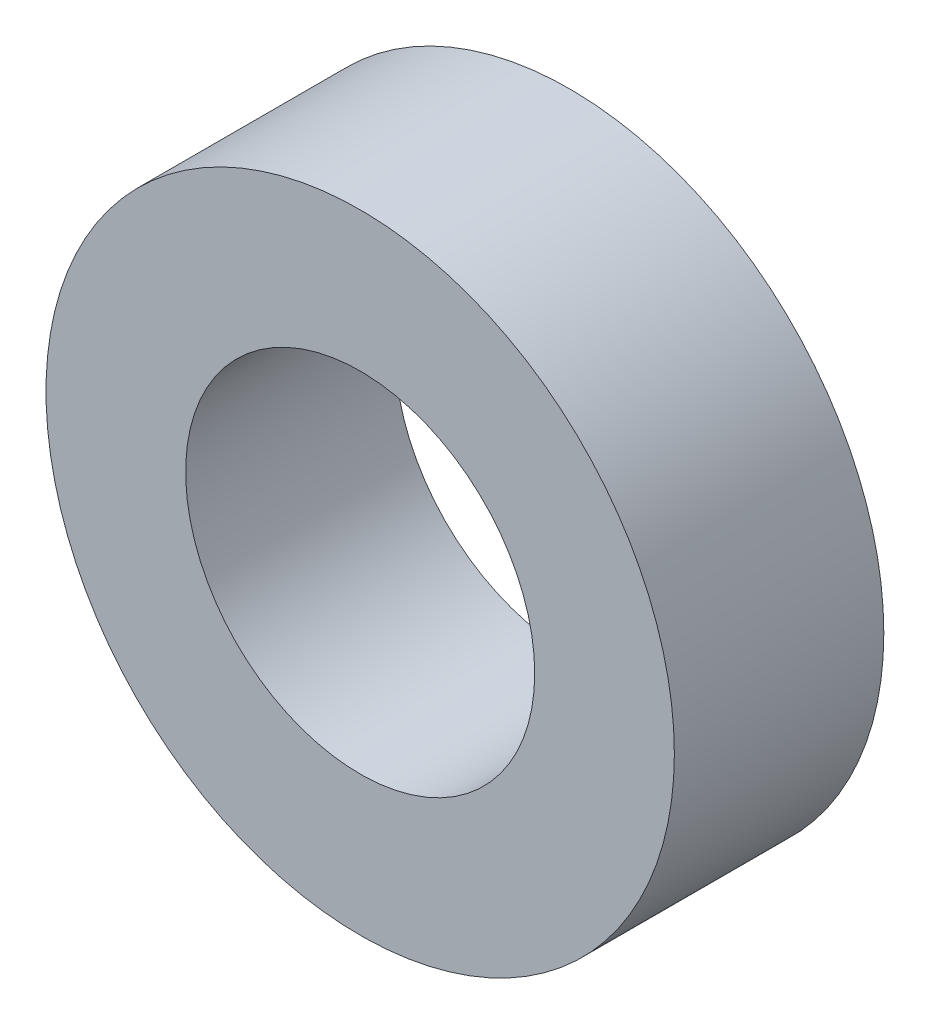
ISO-10303-21;
HEADER;
FILE_DESCRIPTION(('STEP AP214'),'2;1');
FILE_NAME('part.step','',(''),(''),'','','');
FILE_SCHEMA(('AUTOMOTIVE_DESIGN { 1 0 10303 214 1 1 1 1 }'));
ENDSEC;
DATA;
#1=APPLICATION_CONTEXT('core data for automotive mechanical design processes');
#2=APPLICATION_PROTOCOL_DEFINITION('international standard','automotive_design',2000,#1);
#3=PRODUCT_CONTEXT('',#1,'mechanical');
#4=PRODUCT('Part','Part','',(#3));
#5=PRODUCT_RELATED_PRODUCT_CATEGORY('part','',(#4));
#6=PRODUCT_DEFINITION_FORMATION('','',#4);
#7=PRODUCT_DEFINITION_CONTEXT('part definition',#1,'design');
#8=PRODUCT_DEFINITION('design','',#6,#7);
#9=PRODUCT_DEFINITION_SHAPE('','',#8);
#10=(LENGTH_UNIT() NAMED_UNIT(*) SI_UNIT(.MILLI.,.METRE.));
#11=(NAMED_UNIT(*) PLANE_ANGLE_UNIT() SI_UNIT($,.RADIAN.));
#12=(NAMED_UNIT(*) SI_UNIT($,.STERADIAN.) SOLID_ANGLE_UNIT());
#13=UNCERTAINTY_MEASURE_WITH_UNIT(LENGTH_MEASURE(1.E-05),#10,'distance_accuracy_value','');
#14=(GEOMETRIC_REPRESENTATION_CONTEXT(3) GLOBAL_UNCERTAINTY_ASSIGNED_CONTEXT((#13)) GLOBAL_UNIT_ASSIGNED_CONTEXT((#10,
#11,#12)) REPRESENTATION_CONTEXT('',''));
#15=CARTESIAN_POINT('',(0.,0.,0.));
#16=DIRECTION('',(0.,0.,1.));
#17=DIRECTION('',(1.,0.,0.));
#18=AXIS2_PLACEMENT_3D('',#15,#16,#17);
#19=CARTESIAN_POINT('',(0.,0.,3.));
#20=DIRECTION('',(0.,0.,1.));
#21=DIRECTION('',(1.,0.,0.));
#22=AXIS2_PLACEMENT_3D('',#19,#20,#21);
#23=PLANE('',#22);
#24=CARTESIAN_POINT('',(0.,0.,3.));
#25=DIRECTION('',(0.,0.,1.));
#26=DIRECTION('',(1.,0.,0.));
#27=AXIS2_PLACEMENT_3D('',#24,#25,#26);
#28=CIRCLE('',#27,4.5);
#29=CARTESIAN_POINT('',(4.5,0.,3.));
#30=VERTEX_POINT('',#29);
#31=EDGE_CURVE('E10',#30,#30,#28,.T.);
#32=ORIENTED_EDGE('',*,*,#31,.T.);
#33=EDGE_LOOP('',(#32));
#34=FACE_BOUND('',#33,.T.);
#35=CARTESIAN_POINT('',(0.,0.,3.));
#36=DIRECTION('',(0.,0.,1.));
#37=DIRECTION('',(1.,0.,0.));
#38=AXIS2_PLACEMENT_3D('',#35,#36,#37);
#39=CIRCLE('',#38,2.5);
#40=CARTESIAN_POINT('',(2.5,0.,3.));
#41=VERTEX_POINT('',#40);
#42=EDGE_CURVE('E50',#41,#41,#39,.T.);
#43=ORIENTED_EDGE('',*,*,#42,.F.);
#44=EDGE_LOOP('',(#43));
#45=FACE_BOUND('',#44,.T.);
#46=ADVANCED_FACE('F37',(#34,#45),#23,.T.);
#47=CARTESIAN_POINT('',(0.,0.,0.));
#48=DIRECTION('',(0.,0.,1.));
#49=DIRECTION('',(1.,0.,0.));
#50=AXIS2_PLACEMENT_3D('',#47,#48,#49);
#51=PLANE('',#50);
#52=CARTESIAN_POINT('',(0.,0.,0.));
#53=DIRECTION('',(0.,0.,1.));
#54=DIRECTION('',(1.,0.,0.));
#55=AXIS2_PLACEMENT_3D('',#52,#53,#54);
#56=CIRCLE('',#55,4.5);
#57=CARTESIAN_POINT('',(4.5,0.,0.));
#58=VERTEX_POINT('',#57);
#59=EDGE_CURVE('E41',#58,#58,#56,.T.);
#60=ORIENTED_EDGE('',*,*,#59,.F.);
#61=EDGE_LOOP('',(#60));
#62=FACE_BOUND('',#61,.T.);
#63=CARTESIAN_POINT('',(0.,0.,0.));
#64=DIRECTION('',(0.,0.,1.));
#65=DIRECTION('',(1.,0.,0.));
#66=AXIS2_PLACEMENT_3D('',#63,#64,#65);
#67=CIRCLE('',#66,2.5);
#68=CARTESIAN_POINT('',(2.5,0.,0.));
#69=VERTEX_POINT('',#68);
#70=EDGE_CURVE('E52',#69,#69,#67,.T.);
#71=ORIENTED_EDGE('',*,*,#70,.T.);
#72=EDGE_LOOP('',(#71));
#73=FACE_BOUND('',#72,.T.);
#74=ADVANCED_FACE('F64',(#62,#73),#51,.F.);
#75=CARTESIAN_POINT('',(0.,0.,3.));
#76=DIRECTION('',(0.,0.,-1.));
#77=DIRECTION('',(-1.,0.,0.));
#78=AXIS2_PLACEMENT_3D('',#75,#76,#77);
#79=CYLINDRICAL_SURFACE('',#78,4.5);
#80=ORIENTED_EDGE('',*,*,#31,.F.);
#81=EDGE_LOOP('',(#80));
#82=FACE_BOUND('',#81,.T.);
#83=ORIENTED_EDGE('',*,*,#59,.T.);
#84=EDGE_LOOP('',(#83));
#85=FACE_BOUND('',#84,.T.);
#86=ADVANCED_FACE('F39',(#82,#85),#79,.T.);
#87=CARTESIAN_POINT('',(0.,0.,3.));
#88=DIRECTION('',(0.,0.,-1.));
#89=DIRECTION('',(-1.,0.,0.));
#90=AXIS2_PLACEMENT_3D('',#87,#88,#89);
#91=CYLINDRICAL_SURFACE('',#90,2.5);
#92=ORIENTED_EDGE('',*,*,#42,.T.);
#93=EDGE_LOOP('',(#92));
#94=FACE_BOUND('',#93,.T.);
#95=ORIENTED_EDGE('',*,*,#70,.F.);
#96=EDGE_LOOP('',(#95));
#97=FACE_BOUND('',#96,.T.);
#98=ADVANCED_FACE('F60',(#94,#97),#91,.F.);
#99=CLOSED_SHELL('',(#46,#74,#86,#98));
#100=MANIFOLD_SOLID_BREP('B2',#99);
#101=ADVANCED_BREP_SHAPE_REPRESENTATION('',(#18,#100),#14);
#102=SHAPE_DEFINITION_REPRESENTATION(#9,#101);
ENDSEC;
END-ISO-10303-21;
